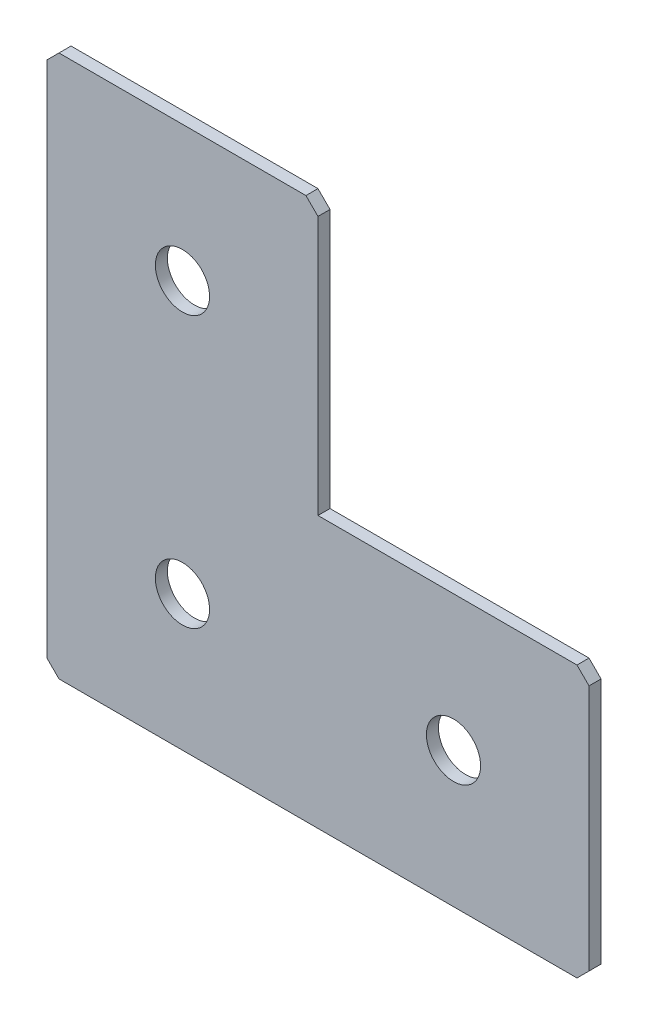
ISO-10303-21;
HEADER;
FILE_DESCRIPTION(('STEP AP214'),'2;1');
FILE_NAME('part.step','',(''),(''),'','','');
FILE_SCHEMA(('AUTOMOTIVE_DESIGN { 1 0 10303 214 1 1 1 1 }'));
ENDSEC;
DATA;
#1=APPLICATION_CONTEXT('core data for automotive mechanical design processes');
#2=APPLICATION_PROTOCOL_DEFINITION('international standard','automotive_design',2000,#1);
#3=PRODUCT_CONTEXT('',#1,'mechanical');
#4=PRODUCT('Part','Part','',(#3));
#5=PRODUCT_RELATED_PRODUCT_CATEGORY('part','',(#4));
#6=PRODUCT_DEFINITION_FORMATION('','',#4);
#7=PRODUCT_DEFINITION_CONTEXT('part definition',#1,'design');
#8=PRODUCT_DEFINITION('design','',#6,#7);
#9=PRODUCT_DEFINITION_SHAPE('','',#8);
#10=(LENGTH_UNIT() NAMED_UNIT(*) SI_UNIT(.MILLI.,.METRE.));
#11=(NAMED_UNIT(*) PLANE_ANGLE_UNIT() SI_UNIT($,.RADIAN.));
#12=(NAMED_UNIT(*) SI_UNIT($,.STERADIAN.) SOLID_ANGLE_UNIT());
#13=UNCERTAINTY_MEASURE_WITH_UNIT(LENGTH_MEASURE(1.E-05),#10,'distance_accuracy_value','');
#14=(GEOMETRIC_REPRESENTATION_CONTEXT(3) GLOBAL_UNCERTAINTY_ASSIGNED_CONTEXT((#13)) GLOBAL_UNIT_ASSIGNED_CONTEXT((#10,
#11,#12)) REPRESENTATION_CONTEXT('',''));
#15=CARTESIAN_POINT('',(0.,0.,0.));
#16=DIRECTION('',(0.,0.,1.));
#17=DIRECTION('',(1.,0.,0.));
#18=AXIS2_PLACEMENT_3D('',#15,#16,#17);
#19=CARTESIAN_POINT('',(45.,0.,-2.));
#20=DIRECTION('',(0.,-1.,0.));
#21=DIRECTION('',(1.,0.,0.));
#22=AXIS2_PLACEMENT_3D('',#19,#20,#21);
#23=PLANE('',#22);
#24=DIRECTION('',(1.,0.,0.));
#25=VECTOR('',#24,1.);
#26=CARTESIAN_POINT('',(45.,0.,-2.));
#27=LINE('',#26,#25);
#28=CARTESIAN_POINT('',(2.00000000000003,0.,-2.));
#29=VERTEX_POINT('',#28);
#30=CARTESIAN_POINT('',(43.,0.,-2.));
#31=VERTEX_POINT('',#30);
#32=EDGE_CURVE('E139',#29,#31,#27,.T.);
#33=ORIENTED_EDGE('',*,*,#32,.F.);
#34=DIRECTION('',(0.,0.,1.));
#35=VECTOR('',#34,1.);
#36=CARTESIAN_POINT('',(2.00000000000002,0.,-2.));
#37=LINE('',#36,#35);
#38=CARTESIAN_POINT('',(2.00000000000003,0.,0.));
#39=VERTEX_POINT('',#38);
#40=EDGE_CURVE('E192',#29,#39,#37,.T.);
#41=ORIENTED_EDGE('',*,*,#40,.T.);
#42=DIRECTION('',(1.,0.,0.));
#43=VECTOR('',#42,1.);
#44=CARTESIAN_POINT('',(45.,0.,0.));
#45=LINE('',#44,#43);
#46=CARTESIAN_POINT('',(43.,0.,0.));
#47=VERTEX_POINT('',#46);
#48=EDGE_CURVE('E169',#39,#47,#45,.T.);
#49=ORIENTED_EDGE('',*,*,#48,.T.);
#50=DIRECTION('',(0.,0.,-1.));
#51=VECTOR('',#50,1.);
#52=CARTESIAN_POINT('',(43.,0.,-2.));
#53=LINE('',#52,#51);
#54=EDGE_CURVE('E150',#47,#31,#53,.T.);
#55=ORIENTED_EDGE('',*,*,#54,.T.);
#56=EDGE_LOOP('',(#33,#41,#49,#55));
#57=FACE_BOUND('',#56,.T.);
#58=ADVANCED_FACE('F41',(#57),#23,.F.);
#59=CARTESIAN_POINT('',(45.,-45.,-2.));
#60=DIRECTION('',(-1.,0.,0.));
#61=DIRECTION('',(0.,-1.,0.));
#62=AXIS2_PLACEMENT_3D('',#59,#60,#61);
#63=PLANE('',#62);
#64=DIRECTION('',(0.,-1.,0.));
#65=VECTOR('',#64,1.);
#66=CARTESIAN_POINT('',(45.,-45.,-2.));
#67=LINE('',#66,#65);
#68=CARTESIAN_POINT('',(45.,-2.00000000000003,-2.));
#69=VERTEX_POINT('',#68);
#70=CARTESIAN_POINT('',(45.,-45.,-2.));
#71=VERTEX_POINT('',#70);
#72=EDGE_CURVE('E125',#69,#71,#67,.T.);
#73=ORIENTED_EDGE('',*,*,#72,.F.);
#74=DIRECTION('',(0.,0.,1.));
#75=VECTOR('',#74,1.);
#76=CARTESIAN_POINT('',(45.,-2.00000000000002,-2.));
#77=LINE('',#76,#75);
#78=CARTESIAN_POINT('',(45.,-2.00000000000003,0.));
#79=VERTEX_POINT('',#78);
#80=EDGE_CURVE('E231',#69,#79,#77,.T.);
#81=ORIENTED_EDGE('',*,*,#80,.T.);
#82=DIRECTION('',(0.,-1.,0.));
#83=VECTOR('',#82,1.);
#84=CARTESIAN_POINT('',(45.,-45.,0.));
#85=LINE('',#84,#83);
#86=CARTESIAN_POINT('',(45.,-45.,0.));
#87=VERTEX_POINT('',#86);
#88=EDGE_CURVE('E145',#79,#87,#85,.T.);
#89=ORIENTED_EDGE('',*,*,#88,.T.);
#90=DIRECTION('',(0.,0.,1.));
#91=VECTOR('',#90,1.);
#92=CARTESIAN_POINT('',(45.,-45.,-2.));
#93=LINE('',#92,#91);
#94=EDGE_CURVE('E142',#71,#87,#93,.T.);
#95=ORIENTED_EDGE('',*,*,#94,.F.);
#96=EDGE_LOOP('',(#73,#81,#89,#95));
#97=FACE_BOUND('',#96,.T.);
#98=ADVANCED_FACE('F143',(#97),#63,.F.);
#99=CARTESIAN_POINT('',(90.,-45.,-2.));
#100=DIRECTION('',(0.,-1.,0.));
#101=DIRECTION('',(1.,0.,0.));
#102=AXIS2_PLACEMENT_3D('',#99,#100,#101);
#103=PLANE('',#102);
#104=DIRECTION('',(1.,0.,0.));
#105=VECTOR('',#104,1.);
#106=CARTESIAN_POINT('',(90.,-45.,0.));
#107=LINE('',#106,#105);
#108=CARTESIAN_POINT('',(88.,-45.,0.));
#109=VERTEX_POINT('',#108);
#110=EDGE_CURVE('E176',#87,#109,#107,.T.);
#111=ORIENTED_EDGE('',*,*,#110,.T.);
#112=DIRECTION('',(0.,0.,-1.));
#113=VECTOR('',#112,1.);
#114=CARTESIAN_POINT('',(88.,-45.,-2.));
#115=LINE('',#114,#113);
#116=CARTESIAN_POINT('',(88.,-45.,-2.));
#117=VERTEX_POINT('',#116);
#118=EDGE_CURVE('E155',#109,#117,#115,.T.);
#119=ORIENTED_EDGE('',*,*,#118,.T.);
#120=DIRECTION('',(1.,0.,0.));
#121=VECTOR('',#120,1.);
#122=CARTESIAN_POINT('',(90.,-45.,-2.));
#123=LINE('',#122,#121);
#124=EDGE_CURVE('E130',#71,#117,#123,.T.);
#125=ORIENTED_EDGE('',*,*,#124,.F.);
#126=ORIENTED_EDGE('',*,*,#94,.T.);
#127=EDGE_LOOP('',(#111,#119,#125,#126));
#128=FACE_BOUND('',#127,.T.);
#129=ADVANCED_FACE('F153',(#128),#103,.F.);
#130=CARTESIAN_POINT('',(90.,-90.,-2.));
#131=DIRECTION('',(-1.,0.,0.));
#132=DIRECTION('',(0.,0.,1.));
#133=AXIS2_PLACEMENT_3D('',#130,#131,#132);
#134=PLANE('',#133);
#135=DIRECTION('',(0.,-1.,0.));
#136=VECTOR('',#135,1.);
#137=CARTESIAN_POINT('',(90.,-90.,-2.));
#138=LINE('',#137,#136);
#139=CARTESIAN_POINT('',(90.,-47.,-2.));
#140=VERTEX_POINT('',#139);
#141=CARTESIAN_POINT('',(90.,-88.,-2.));
#142=VERTEX_POINT('',#141);
#143=EDGE_CURVE('E157',#140,#142,#138,.T.);
#144=ORIENTED_EDGE('',*,*,#143,.F.);
#145=DIRECTION('',(0.,0.,1.));
#146=VECTOR('',#145,1.);
#147=CARTESIAN_POINT('',(90.,-47.,-2.));
#148=LINE('',#147,#146);
#149=CARTESIAN_POINT('',(90.,-47.,0.));
#150=VERTEX_POINT('',#149);
#151=EDGE_CURVE('E237',#140,#150,#148,.T.);
#152=ORIENTED_EDGE('',*,*,#151,.T.);
#153=DIRECTION('',(0.,-1.,0.));
#154=VECTOR('',#153,1.);
#155=CARTESIAN_POINT('',(90.,-90.,0.));
#156=LINE('',#155,#154);
#157=CARTESIAN_POINT('',(90.,-88.,0.));
#158=VERTEX_POINT('',#157);
#159=EDGE_CURVE('E179',#150,#158,#156,.T.);
#160=ORIENTED_EDGE('',*,*,#159,.T.);
#161=DIRECTION('',(0.,0.,-1.));
#162=VECTOR('',#161,1.);
#163=CARTESIAN_POINT('',(90.,-88.,-2.));
#164=LINE('',#163,#162);
#165=EDGE_CURVE('E234',#158,#142,#164,.T.);
#166=ORIENTED_EDGE('',*,*,#165,.T.);
#167=EDGE_LOOP('',(#144,#152,#160,#166));
#168=FACE_BOUND('',#167,.T.);
#169=ADVANCED_FACE('F340',(#168),#134,.F.);
#170=CARTESIAN_POINT('',(0.,-90.,-2.));
#171=DIRECTION('',(0.,1.,0.));
#172=DIRECTION('',(0.,0.,1.));
#173=AXIS2_PLACEMENT_3D('',#170,#171,#172);
#174=PLANE('',#173);
#175=DIRECTION('',(-1.,0.,0.));
#176=VECTOR('',#175,1.);
#177=CARTESIAN_POINT('',(0.,-90.,-2.));
#178=LINE('',#177,#176);
#179=CARTESIAN_POINT('',(88.,-90.,-2.));
#180=VERTEX_POINT('',#179);
#181=CARTESIAN_POINT('',(2.,-90.,-2.));
#182=VERTEX_POINT('',#181);
#183=EDGE_CURVE('E161',#180,#182,#178,.T.);
#184=ORIENTED_EDGE('',*,*,#183,.F.);
#185=DIRECTION('',(0.,0.,1.));
#186=VECTOR('',#185,1.);
#187=CARTESIAN_POINT('',(88.,-90.,-2.));
#188=LINE('',#187,#186);
#189=CARTESIAN_POINT('',(88.,-90.,0.));
#190=VERTEX_POINT('',#189);
#191=EDGE_CURVE('E11',#180,#190,#188,.T.);
#192=ORIENTED_EDGE('',*,*,#191,.T.);
#193=DIRECTION('',(-1.,0.,0.));
#194=VECTOR('',#193,1.);
#195=CARTESIAN_POINT('',(0.,-90.,0.));
#196=LINE('',#195,#194);
#197=CARTESIAN_POINT('',(2.,-90.,0.));
#198=VERTEX_POINT('',#197);
#199=EDGE_CURVE('E183',#190,#198,#196,.T.);
#200=ORIENTED_EDGE('',*,*,#199,.T.);
#201=DIRECTION('',(0.,0.,-1.));
#202=VECTOR('',#201,1.);
#203=CARTESIAN_POINT('',(2.,-90.,-2.));
#204=LINE('',#203,#202);
#205=EDGE_CURVE('E50',#198,#182,#204,.T.);
#206=ORIENTED_EDGE('',*,*,#205,.T.);
#207=EDGE_LOOP('',(#184,#192,#200,#206));
#208=FACE_BOUND('',#207,.T.);
#209=ADVANCED_FACE('F290',(#208),#174,.F.);
#210=CARTESIAN_POINT('',(0.,0.,-2.));
#211=DIRECTION('',(1.,0.,0.));
#212=DIRECTION('',(0.,0.,-1.));
#213=AXIS2_PLACEMENT_3D('',#210,#211,#212);
#214=PLANE('',#213);
#215=DIRECTION('',(0.,1.,0.));
#216=VECTOR('',#215,1.);
#217=CARTESIAN_POINT('',(0.,0.,0.));
#218=LINE('',#217,#216);
#219=CARTESIAN_POINT('',(0.,-88.,0.));
#220=VERTEX_POINT('',#219);
#221=CARTESIAN_POINT('',(0.,-2.00000000000001,0.));
#222=VERTEX_POINT('',#221);
#223=EDGE_CURVE('E186',#220,#222,#218,.T.);
#224=ORIENTED_EDGE('',*,*,#223,.T.);
#225=DIRECTION('',(0.,0.,-1.));
#226=VECTOR('',#225,1.);
#227=CARTESIAN_POINT('',(0.,-2.00000000000002,-2.));
#228=LINE('',#227,#226);
#229=CARTESIAN_POINT('',(0.,-2.00000000000001,-2.));
#230=VERTEX_POINT('',#229);
#231=EDGE_CURVE('E215',#222,#230,#228,.T.);
#232=ORIENTED_EDGE('',*,*,#231,.T.);
#233=DIRECTION('',(0.,1.,0.));
#234=VECTOR('',#233,1.);
#235=CARTESIAN_POINT('',(0.,0.,-2.));
#236=LINE('',#235,#234);
#237=CARTESIAN_POINT('',(0.,-88.,-2.));
#238=VERTEX_POINT('',#237);
#239=EDGE_CURVE('E151',#238,#230,#236,.T.);
#240=ORIENTED_EDGE('',*,*,#239,.F.);
#241=DIRECTION('',(0.,0.,1.));
#242=VECTOR('',#241,1.);
#243=CARTESIAN_POINT('',(0.,-88.,-2.));
#244=LINE('',#243,#242);
#245=EDGE_CURVE('E211',#238,#220,#244,.T.);
#246=ORIENTED_EDGE('',*,*,#245,.T.);
#247=EDGE_LOOP('',(#224,#232,#240,#246));
#248=FACE_BOUND('',#247,.T.);
#249=ADVANCED_FACE('F281',(#248),#214,.F.);
#250=CARTESIAN_POINT('',(0.,0.,-2.));
#251=DIRECTION('',(0.,0.,1.));
#252=DIRECTION('',(1.,0.,0.));
#253=AXIS2_PLACEMENT_3D('',#250,#251,#252);
#254=PLANE('',#253);
#255=CARTESIAN_POINT('',(22.5,-67.5,-2.));
#256=DIRECTION('',(0.,0.,-1.));
#257=DIRECTION('',(0.,1.,0.));
#258=AXIS2_PLACEMENT_3D('',#255,#256,#257);
#259=CIRCLE('',#258,4.5);
#260=CARTESIAN_POINT('',(22.5,-63.,-2.));
#261=VERTEX_POINT('',#260);
#262=EDGE_CURVE('E244',#261,#261,#259,.T.);
#263=ORIENTED_EDGE('',*,*,#262,.F.);
#264=EDGE_LOOP('',(#263));
#265=FACE_BOUND('',#264,.T.);
#266=CARTESIAN_POINT('',(22.5,-22.5,-2.));
#267=DIRECTION('',(0.,0.,-1.));
#268=DIRECTION('',(0.,1.,0.));
#269=AXIS2_PLACEMENT_3D('',#266,#267,#268);
#270=CIRCLE('',#269,4.5);
#271=CARTESIAN_POINT('',(22.5,-18.,-2.));
#272=VERTEX_POINT('',#271);
#273=EDGE_CURVE('E254',#272,#272,#270,.T.);
#274=ORIENTED_EDGE('',*,*,#273,.F.);
#275=EDGE_LOOP('',(#274));
#276=FACE_BOUND('',#275,.T.);
#277=CARTESIAN_POINT('',(67.5,-67.5,-2.));
#278=DIRECTION('',(0.,0.,-1.));
#279=DIRECTION('',(0.,1.,0.));
#280=AXIS2_PLACEMENT_3D('',#277,#278,#279);
#281=CIRCLE('',#280,4.5);
#282=CARTESIAN_POINT('',(67.5,-63.,-2.));
#283=VERTEX_POINT('',#282);
#284=EDGE_CURVE('E253',#283,#283,#281,.T.);
#285=ORIENTED_EDGE('',*,*,#284,.F.);
#286=EDGE_LOOP('',(#285));
#287=FACE_BOUND('',#286,.T.);
#288=ORIENTED_EDGE('',*,*,#239,.T.);
#289=DIRECTION('',(-0.707106781186548,-0.707106781186548,0.));
#290=VECTOR('',#289,1.);
#291=CARTESIAN_POINT('',(2.00000000000002,0.,-2.));
#292=LINE('',#291,#290);
#293=EDGE_CURVE('E228',#230,#29,#292,.F.);
#294=ORIENTED_EDGE('',*,*,#293,.T.);
#295=ORIENTED_EDGE('',*,*,#32,.T.);
#296=DIRECTION('',(-0.707106781186548,0.707106781186547,0.));
#297=VECTOR('',#296,1.);
#298=CARTESIAN_POINT('',(45.,-2.00000000000002,-2.));
#299=LINE('',#298,#297);
#300=EDGE_CURVE('E134',#31,#69,#299,.F.);
#301=ORIENTED_EDGE('',*,*,#300,.T.);
#302=ORIENTED_EDGE('',*,*,#72,.T.);
#303=ORIENTED_EDGE('',*,*,#124,.T.);
#304=DIRECTION('',(-0.707106781186545,0.70710678118655,0.));
#305=VECTOR('',#304,1.);
#306=CARTESIAN_POINT('',(90.,-47.,-2.));
#307=LINE('',#306,#305);
#308=EDGE_CURVE('E223',#117,#140,#307,.F.);
#309=ORIENTED_EDGE('',*,*,#308,.T.);
#310=ORIENTED_EDGE('',*,*,#143,.T.);
#311=DIRECTION('',(0.707106781186545,0.70710678118655,0.));
#312=VECTOR('',#311,1.);
#313=CARTESIAN_POINT('',(88.,-90.,-2.));
#314=LINE('',#313,#312);
#315=EDGE_CURVE('E63',#142,#180,#314,.F.);
#316=ORIENTED_EDGE('',*,*,#315,.T.);
#317=ORIENTED_EDGE('',*,*,#183,.T.);
#318=DIRECTION('',(0.70710678118655,-0.707106781186545,0.));
#319=VECTOR('',#318,1.);
#320=CARTESIAN_POINT('',(0.,-88.,-2.));
#321=LINE('',#320,#319);
#322=EDGE_CURVE('E218',#182,#238,#321,.F.);
#323=ORIENTED_EDGE('',*,*,#322,.T.);
#324=EDGE_LOOP('',(#288,#294,#295,#301,#302,#303,#309,#310,#316,#317,#323));
#325=FACE_BOUND('',#324,.T.);
#326=ADVANCED_FACE('F128',(#265,#276,#287,#325),#254,.F.);
#327=CARTESIAN_POINT('',(0.,0.,0.));
#328=DIRECTION('',(0.,0.,1.));
#329=DIRECTION('',(1.,0.,0.));
#330=AXIS2_PLACEMENT_3D('',#327,#328,#329);
#331=PLANE('',#330);
#332=CARTESIAN_POINT('',(22.5,-67.5,0.));
#333=DIRECTION('',(0.,0.,-1.));
#334=DIRECTION('',(0.,1.,0.));
#335=AXIS2_PLACEMENT_3D('',#332,#333,#334);
#336=CIRCLE('',#335,4.5);
#337=CARTESIAN_POINT('',(22.5,-63.,0.));
#338=VERTEX_POINT('',#337);
#339=EDGE_CURVE('E246',#338,#338,#336,.T.);
#340=ORIENTED_EDGE('',*,*,#339,.T.);
#341=EDGE_LOOP('',(#340));
#342=FACE_BOUND('',#341,.T.);
#343=CARTESIAN_POINT('',(22.5,-22.5,0.));
#344=DIRECTION('',(0.,0.,-1.));
#345=DIRECTION('',(0.,1.,0.));
#346=AXIS2_PLACEMENT_3D('',#343,#344,#345);
#347=CIRCLE('',#346,4.5);
#348=CARTESIAN_POINT('',(22.5,-18.,0.));
#349=VERTEX_POINT('',#348);
#350=EDGE_CURVE('E250',#349,#349,#347,.T.);
#351=ORIENTED_EDGE('',*,*,#350,.T.);
#352=EDGE_LOOP('',(#351));
#353=FACE_BOUND('',#352,.T.);
#354=CARTESIAN_POINT('',(67.5,-67.5,0.));
#355=DIRECTION('',(0.,0.,-1.));
#356=DIRECTION('',(0.,1.,0.));
#357=AXIS2_PLACEMENT_3D('',#354,#355,#356);
#358=CIRCLE('',#357,4.5);
#359=CARTESIAN_POINT('',(67.5,-63.,0.));
#360=VERTEX_POINT('',#359);
#361=EDGE_CURVE('E173',#360,#360,#358,.T.);
#362=ORIENTED_EDGE('',*,*,#361,.T.);
#363=EDGE_LOOP('',(#362));
#364=FACE_BOUND('',#363,.T.);
#365=ORIENTED_EDGE('',*,*,#48,.F.);
#366=DIRECTION('',(0.707106781186548,0.707106781186548,0.));
#367=VECTOR('',#366,1.);
#368=CARTESIAN_POINT('',(1.00000000000001,-1.00000000000001,0.));
#369=LINE('',#368,#367);
#370=EDGE_CURVE('E208',#39,#222,#369,.F.);
#371=ORIENTED_EDGE('',*,*,#370,.T.);
#372=ORIENTED_EDGE('',*,*,#223,.F.);
#373=DIRECTION('',(-0.70710678118655,0.707106781186545,0.));
#374=VECTOR('',#373,1.);
#375=CARTESIAN_POINT('',(-44.,-44.0000000000003,0.));
#376=LINE('',#375,#374);
#377=EDGE_CURVE('E196',#220,#198,#376,.F.);
#378=ORIENTED_EDGE('',*,*,#377,.T.);
#379=ORIENTED_EDGE('',*,*,#199,.F.);
#380=DIRECTION('',(-0.707106781186545,-0.70710678118655,0.));
#381=VECTOR('',#380,1.);
#382=CARTESIAN_POINT('',(89.0000000000003,-88.9999999999997,0.));
#383=LINE('',#382,#381);
#384=EDGE_CURVE('E199',#190,#158,#383,.F.);
#385=ORIENTED_EDGE('',*,*,#384,.T.);
#386=ORIENTED_EDGE('',*,*,#159,.F.);
#387=DIRECTION('',(0.707106781186545,-0.70710678118655,0.));
#388=VECTOR('',#387,1.);
#389=CARTESIAN_POINT('',(21.5000000000003,21.5000000000002,0.));
#390=LINE('',#389,#388);
#391=EDGE_CURVE('E202',#150,#109,#390,.F.);
#392=ORIENTED_EDGE('',*,*,#391,.T.);
#393=ORIENTED_EDGE('',*,*,#110,.F.);
#394=ORIENTED_EDGE('',*,*,#88,.F.);
#395=DIRECTION('',(0.707106781186548,-0.707106781186547,0.));
#396=VECTOR('',#395,1.);
#397=CARTESIAN_POINT('',(21.5,21.5,0.));
#398=LINE('',#397,#396);
#399=EDGE_CURVE('E205',#79,#47,#398,.F.);
#400=ORIENTED_EDGE('',*,*,#399,.T.);
#401=EDGE_LOOP('',(#365,#371,#372,#378,#379,#385,#386,#392,#393,#394,#400));
#402=FACE_BOUND('',#401,.T.);
#403=ADVANCED_FACE('F270',(#342,#353,#364,#402),#331,.T.);
#404=CARTESIAN_POINT('',(67.5,-67.5,-2.));
#405=DIRECTION('',(0.,0.,-1.));
#406=DIRECTION('',(0.,1.,0.));
#407=AXIS2_PLACEMENT_3D('',#404,#405,#406);
#408=CYLINDRICAL_SURFACE('',#407,4.5);
#409=ORIENTED_EDGE('',*,*,#361,.F.);
#410=EDGE_LOOP('',(#409));
#411=FACE_BOUND('',#410,.T.);
#412=ORIENTED_EDGE('',*,*,#284,.T.);
#413=EDGE_LOOP('',(#412));
#414=FACE_BOUND('',#413,.T.);
#415=ADVANCED_FACE('F273',(#411,#414),#408,.F.);
#416=CARTESIAN_POINT('',(22.5,-22.5,-2.));
#417=DIRECTION('',(0.,0.,-1.));
#418=DIRECTION('',(0.,1.,0.));
#419=AXIS2_PLACEMENT_3D('',#416,#417,#418);
#420=CYLINDRICAL_SURFACE('',#419,4.5);
#421=ORIENTED_EDGE('',*,*,#350,.F.);
#422=EDGE_LOOP('',(#421));
#423=FACE_BOUND('',#422,.T.);
#424=ORIENTED_EDGE('',*,*,#273,.T.);
#425=EDGE_LOOP('',(#424));
#426=FACE_BOUND('',#425,.T.);
#427=ADVANCED_FACE('F276',(#423,#426),#420,.F.);
#428=CARTESIAN_POINT('',(22.5,-67.5,-2.));
#429=DIRECTION('',(0.,0.,-1.));
#430=DIRECTION('',(0.,1.,0.));
#431=AXIS2_PLACEMENT_3D('',#428,#429,#430);
#432=CYLINDRICAL_SURFACE('',#431,4.5);
#433=ORIENTED_EDGE('',*,*,#339,.F.);
#434=EDGE_LOOP('',(#433));
#435=FACE_BOUND('',#434,.T.);
#436=ORIENTED_EDGE('',*,*,#262,.T.);
#437=EDGE_LOOP('',(#436));
#438=FACE_BOUND('',#437,.T.);
#439=ADVANCED_FACE('F309',(#435,#438),#432,.F.);
#440=CARTESIAN_POINT('',(2.00000000000002,0.,-2.));
#441=DIRECTION('',(0.707106781186547,-0.707106781186547,0.));
#442=DIRECTION('',(0.,0.,1.));
#443=AXIS2_PLACEMENT_3D('',#440,#441,#442);
#444=PLANE('',#443);
#445=ORIENTED_EDGE('',*,*,#293,.F.);
#446=ORIENTED_EDGE('',*,*,#231,.F.);
#447=ORIENTED_EDGE('',*,*,#370,.F.);
#448=ORIENTED_EDGE('',*,*,#40,.F.);
#449=EDGE_LOOP('',(#445,#446,#447,#448));
#450=FACE_BOUND('',#449,.T.);
#451=ADVANCED_FACE('F305',(#450),#444,.F.);
#452=CARTESIAN_POINT('',(45.,-2.00000000000002,-2.));
#453=DIRECTION('',(-0.707106781186547,-0.707106781186548,0.));
#454=DIRECTION('',(0.,0.,1.));
#455=AXIS2_PLACEMENT_3D('',#452,#453,#454);
#456=PLANE('',#455);
#457=ORIENTED_EDGE('',*,*,#300,.F.);
#458=ORIENTED_EDGE('',*,*,#54,.F.);
#459=ORIENTED_EDGE('',*,*,#399,.F.);
#460=ORIENTED_EDGE('',*,*,#80,.F.);
#461=EDGE_LOOP('',(#457,#458,#459,#460));
#462=FACE_BOUND('',#461,.T.);
#463=ADVANCED_FACE('F308',(#462),#456,.F.);
#464=CARTESIAN_POINT('',(90.,-47.,-2.));
#465=DIRECTION('',(-0.70710678118655,-0.707106781186545,0.));
#466=DIRECTION('',(0.,0.,1.));
#467=AXIS2_PLACEMENT_3D('',#464,#465,#466);
#468=PLANE('',#467);
#469=ORIENTED_EDGE('',*,*,#308,.F.);
#470=ORIENTED_EDGE('',*,*,#118,.F.);
#471=ORIENTED_EDGE('',*,*,#391,.F.);
#472=ORIENTED_EDGE('',*,*,#151,.F.);
#473=EDGE_LOOP('',(#469,#470,#471,#472));
#474=FACE_BOUND('',#473,.T.);
#475=ADVANCED_FACE('F313',(#474),#468,.F.);
#476=CARTESIAN_POINT('',(88.,-90.,-2.));
#477=DIRECTION('',(-0.70710678118655,0.707106781186545,0.));
#478=DIRECTION('',(0.,0.,1.));
#479=AXIS2_PLACEMENT_3D('',#476,#477,#478);
#480=PLANE('',#479);
#481=ORIENTED_EDGE('',*,*,#315,.F.);
#482=ORIENTED_EDGE('',*,*,#165,.F.);
#483=ORIENTED_EDGE('',*,*,#384,.F.);
#484=ORIENTED_EDGE('',*,*,#191,.F.);
#485=EDGE_LOOP('',(#481,#482,#483,#484));
#486=FACE_BOUND('',#485,.T.);
#487=ADVANCED_FACE('F316',(#486),#480,.F.);
#488=CARTESIAN_POINT('',(0.,-88.,-2.));
#489=DIRECTION('',(0.707106781186545,0.70710678118655,0.));
#490=DIRECTION('',(0.,0.,1.));
#491=AXIS2_PLACEMENT_3D('',#488,#489,#490);
#492=PLANE('',#491);
#493=ORIENTED_EDGE('',*,*,#322,.F.);
#494=ORIENTED_EDGE('',*,*,#205,.F.);
#495=ORIENTED_EDGE('',*,*,#377,.F.);
#496=ORIENTED_EDGE('',*,*,#245,.F.);
#497=EDGE_LOOP('',(#493,#494,#495,#496));
#498=FACE_BOUND('',#497,.T.);
#499=ADVANCED_FACE('F43',(#498),#492,.F.);
#500=CLOSED_SHELL('',(#58,#98,#129,#169,#209,#249,#326,#403,#415,#427,#439,#451,#463,#475,#487,#499));
#501=MANIFOLD_SOLID_BREP('B2',#500);
#502=ADVANCED_BREP_SHAPE_REPRESENTATION('',(#18,#501),#14);
#503=SHAPE_DEFINITION_REPRESENTATION(#9,#502);
ENDSEC;
END-ISO-10303-21;
